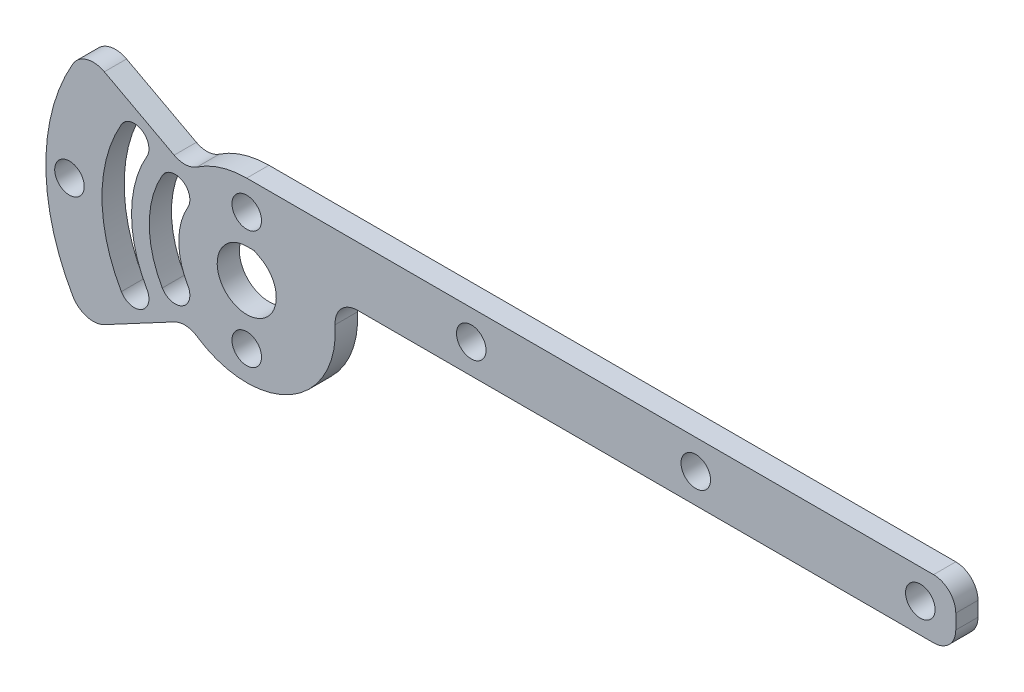
ISO-10303-21;
HEADER;
FILE_DESCRIPTION(('STEP AP214'),'2;1');
FILE_NAME('part.step','',(''),(''),'','','');
FILE_SCHEMA(('AUTOMOTIVE_DESIGN { 1 0 10303 214 1 1 1 1 }'));
ENDSEC;
DATA;
#1=APPLICATION_CONTEXT('core data for automotive mechanical design processes');
#2=APPLICATION_PROTOCOL_DEFINITION('international standard','automotive_design',2000,#1);
#3=PRODUCT_CONTEXT('',#1,'mechanical');
#4=PRODUCT('Part','Part','',(#3));
#5=PRODUCT_RELATED_PRODUCT_CATEGORY('part','',(#4));
#6=PRODUCT_DEFINITION_FORMATION('','',#4);
#7=PRODUCT_DEFINITION_CONTEXT('part definition',#1,'design');
#8=PRODUCT_DEFINITION('design','',#6,#7);
#9=PRODUCT_DEFINITION_SHAPE('','',#8);
#10=(LENGTH_UNIT() NAMED_UNIT(*) SI_UNIT(.MILLI.,.METRE.));
#11=(NAMED_UNIT(*) PLANE_ANGLE_UNIT() SI_UNIT($,.RADIAN.));
#12=(NAMED_UNIT(*) SI_UNIT($,.STERADIAN.) SOLID_ANGLE_UNIT());
#13=UNCERTAINTY_MEASURE_WITH_UNIT(LENGTH_MEASURE(1.E-05),#10,'distance_accuracy_value','');
#14=(GEOMETRIC_REPRESENTATION_CONTEXT(3) GLOBAL_UNCERTAINTY_ASSIGNED_CONTEXT((#13)) GLOBAL_UNIT_ASSIGNED_CONTEXT((#10,
#11,#12)) REPRESENTATION_CONTEXT('',''));
#15=CARTESIAN_POINT('',(0.,0.,0.));
#16=DIRECTION('',(0.,0.,1.));
#17=DIRECTION('',(1.,0.,0.));
#18=AXIS2_PLACEMENT_3D('',#15,#16,#17);
#19=CARTESIAN_POINT('',(2.98992691040184,5.60203865306684,4.7752));
#20=DIRECTION('',(0.470854631559345,0.882210811506589,0.));
#21=DIRECTION('',(-0.882210811506589,0.470854631559345,0.));
#22=AXIS2_PLACEMENT_3D('',#19,#20,#21);
#23=PLANE('',#22);
#24=DIRECTION('',(0.882210811506589,-0.470854631559345,0.));
#25=VECTOR('',#24,1.);
#26=CARTESIAN_POINT('',(2.98992691040184,5.60203865306684,0.));
#27=LINE('',#26,#25);
#28=CARTESIAN_POINT('',(1.58851861445243,6.35,0.));
#29=VERTEX_POINT('',#28);
#30=CARTESIAN_POINT('',(2.98992691040184,5.60203865306684,0.));
#31=VERTEX_POINT('',#30);
#32=EDGE_CURVE('E341',#29,#31,#27,.T.);
#33=ORIENTED_EDGE('',*,*,#32,.T.);
#34=DIRECTION('',(0.,0.,-1.));
#35=VECTOR('',#34,1.);
#36=CARTESIAN_POINT('',(2.98992691040184,5.60203865306684,4.7752));
#37=LINE('',#36,#35);
#38=CARTESIAN_POINT('',(2.98992691040184,5.60203865306684,4.7752));
#39=VERTEX_POINT('',#38);
#40=EDGE_CURVE('E357',#39,#31,#37,.T.);
#41=ORIENTED_EDGE('',*,*,#40,.F.);
#42=DIRECTION('',(0.882210811506589,-0.470854631559345,0.));
#43=VECTOR('',#42,1.);
#44=CARTESIAN_POINT('',(2.98992691040184,5.60203865306684,4.7752));
#45=LINE('',#44,#43);
#46=CARTESIAN_POINT('',(1.58851861445243,6.35,4.7752));
#47=VERTEX_POINT('',#46);
#48=EDGE_CURVE('E282',#47,#39,#45,.T.);
#49=ORIENTED_EDGE('',*,*,#48,.F.);
#50=DIRECTION('',(0.,0.,-1.));
#51=VECTOR('',#50,1.);
#52=CARTESIAN_POINT('',(1.58851861445243,6.35,4.7752));
#53=LINE('',#52,#51);
#54=EDGE_CURVE('E351',#47,#29,#53,.T.);
#55=ORIENTED_EDGE('',*,*,#54,.T.);
#56=EDGE_LOOP('',(#33,#41,#49,#55));
#57=FACE_BOUND('',#56,.T.);
#58=ADVANCED_FACE('F35',(#57),#23,.F.);
#59=CARTESIAN_POINT('',(0.,0.,4.7752));
#60=DIRECTION('',(0.,0.,-1.));
#61=DIRECTION('',(-1.,0.,0.));
#62=AXIS2_PLACEMENT_3D('',#59,#60,#61);
#63=CYLINDRICAL_SURFACE('',#62,6.35);
#64=CARTESIAN_POINT('',(0.,0.,0.));
#65=DIRECTION('',(0.,0.,1.));
#66=DIRECTION('',(1.,0.,0.));
#67=AXIS2_PLACEMENT_3D('',#64,#65,#66);
#68=CIRCLE('',#67,6.35);
#69=CARTESIAN_POINT('',(0.,6.35,0.));
#70=VERTEX_POINT('',#69);
#71=EDGE_CURVE('E344',#70,#31,#68,.T.);
#72=ORIENTED_EDGE('',*,*,#71,.F.);
#73=DIRECTION('',(0.,0.,-1.));
#74=VECTOR('',#73,1.);
#75=CARTESIAN_POINT('',(0.,6.35,4.7752));
#76=LINE('',#75,#74);
#77=CARTESIAN_POINT('',(0.,6.35,4.7752));
#78=VERTEX_POINT('',#77);
#79=EDGE_CURVE('E354',#78,#70,#76,.T.);
#80=ORIENTED_EDGE('',*,*,#79,.F.);
#81=CARTESIAN_POINT('',(0.,0.,4.7752));
#82=DIRECTION('',(0.,0.,1.));
#83=DIRECTION('',(1.,0.,0.));
#84=AXIS2_PLACEMENT_3D('',#81,#82,#83);
#85=CIRCLE('',#84,6.35);
#86=EDGE_CURVE('E284',#78,#39,#85,.T.);
#87=ORIENTED_EDGE('',*,*,#86,.T.);
#88=ORIENTED_EDGE('',*,*,#40,.T.);
#89=EDGE_LOOP('',(#72,#80,#87,#88));
#90=FACE_BOUND('',#89,.T.);
#91=ADVANCED_FACE('F453',(#90),#63,.F.);
#92=CARTESIAN_POINT('',(-15.3979316792874,-8.88999999999991,4.7752));
#93=DIRECTION('',(0.,0.,-1.));
#94=DIRECTION('',(-1.,0.,0.));
#95=AXIS2_PLACEMENT_3D('',#92,#93,#94);
#96=CYLINDRICAL_SURFACE('',#95,3.175);
#97=CARTESIAN_POINT('',(-15.3979316792874,-8.88999999999991,0.));
#98=DIRECTION('',(0.,0.,1.));
#99=DIRECTION('',(1.,0.,0.));
#100=AXIS2_PLACEMENT_3D('',#97,#98,#99);
#101=CIRCLE('',#100,3.175);
#102=CARTESIAN_POINT('',(-12.6483010222718,-7.30249999999992,0.));
#103=VERTEX_POINT('',#102);
#104=CARTESIAN_POINT('',(-18.147562336303,-10.4774999999999,0.));
#105=VERTEX_POINT('',#104);
#106=EDGE_CURVE('E330',#103,#105,#101,.F.);
#107=ORIENTED_EDGE('',*,*,#106,.T.);
#108=DIRECTION('',(0.,0.,-1.));
#109=VECTOR('',#108,1.);
#110=CARTESIAN_POINT('',(-18.147562336303,-10.4774999999999,4.7752));
#111=LINE('',#110,#109);
#112=CARTESIAN_POINT('',(-18.147562336303,-10.4774999999999,4.7752));
#113=VERTEX_POINT('',#112);
#114=EDGE_CURVE('E355',#113,#105,#111,.T.);
#115=ORIENTED_EDGE('',*,*,#114,.F.);
#116=CARTESIAN_POINT('',(-15.3979316792874,-8.88999999999991,4.7752));
#117=DIRECTION('',(0.,0.,1.));
#118=DIRECTION('',(1.,0.,0.));
#119=AXIS2_PLACEMENT_3D('',#116,#117,#118);
#120=CIRCLE('',#119,3.175);
#121=CARTESIAN_POINT('',(-12.6483010222718,-7.30249999999992,4.7752));
#122=VERTEX_POINT('',#121);
#123=EDGE_CURVE('E272',#122,#113,#120,.F.);
#124=ORIENTED_EDGE('',*,*,#123,.F.);
#125=DIRECTION('',(0.,0.,-1.));
#126=VECTOR('',#125,1.);
#127=CARTESIAN_POINT('',(-12.6483010222718,-7.30249999999992,4.7752));
#128=LINE('',#127,#126);
#129=EDGE_CURVE('E360',#122,#103,#128,.T.);
#130=ORIENTED_EDGE('',*,*,#129,.T.);
#131=EDGE_LOOP('',(#107,#115,#124,#130));
#132=FACE_BOUND('',#131,.T.);
#133=ADVANCED_FACE('F459',(#132),#96,.F.);
#134=CARTESIAN_POINT('',(0.,0.,4.7752));
#135=DIRECTION('',(0.,0.,-1.));
#136=DIRECTION('',(-1.,0.,0.));
#137=AXIS2_PLACEMENT_3D('',#134,#135,#136);
#138=CYLINDRICAL_SURFACE('',#137,20.955);
#139=CARTESIAN_POINT('',(0.,0.,0.));
#140=DIRECTION('',(0.,0.,1.));
#141=DIRECTION('',(1.,0.,0.));
#142=AXIS2_PLACEMENT_3D('',#139,#140,#141);
#143=CIRCLE('',#142,20.955);
#144=CARTESIAN_POINT('',(-18.147562336303,10.4774999999999,0.));
#145=VERTEX_POINT('',#144);
#146=EDGE_CURVE('E333',#145,#105,#143,.T.);
#147=ORIENTED_EDGE('',*,*,#146,.F.);
#148=DIRECTION('',(0.,0.,-1.));
#149=VECTOR('',#148,1.);
#150=CARTESIAN_POINT('',(-18.147562336303,10.4774999999999,4.7752));
#151=LINE('',#150,#149);
#152=CARTESIAN_POINT('',(-18.147562336303,10.4774999999999,4.7752));
#153=VERTEX_POINT('',#152);
#154=EDGE_CURVE('E366',#153,#145,#151,.T.);
#155=ORIENTED_EDGE('',*,*,#154,.F.);
#156=CARTESIAN_POINT('',(0.,0.,4.7752));
#157=DIRECTION('',(0.,0.,1.));
#158=DIRECTION('',(1.,0.,0.));
#159=AXIS2_PLACEMENT_3D('',#156,#157,#158);
#160=CIRCLE('',#159,20.955);
#161=EDGE_CURVE('E274',#153,#113,#160,.T.);
#162=ORIENTED_EDGE('',*,*,#161,.T.);
#163=ORIENTED_EDGE('',*,*,#114,.T.);
#164=EDGE_LOOP('',(#147,#155,#162,#163));
#165=FACE_BOUND('',#164,.T.);
#166=ADVANCED_FACE('F474',(#165),#138,.F.);
#167=CARTESIAN_POINT('',(-15.3979316792874,8.8899999999999,4.7752));
#168=DIRECTION('',(0.,0.,-1.));
#169=DIRECTION('',(-1.,0.,0.));
#170=AXIS2_PLACEMENT_3D('',#167,#168,#169);
#171=CYLINDRICAL_SURFACE('',#170,3.175);
#172=CARTESIAN_POINT('',(-15.3979316792874,8.8899999999999,0.));
#173=DIRECTION('',(0.,0.,1.));
#174=DIRECTION('',(1.,0.,0.));
#175=AXIS2_PLACEMENT_3D('',#172,#173,#174);
#176=CIRCLE('',#175,3.175);
#177=CARTESIAN_POINT('',(-12.6483010222718,7.30249999999992,0.));
#178=VERTEX_POINT('',#177);
#179=EDGE_CURVE('E336',#178,#145,#176,.T.);
#180=ORIENTED_EDGE('',*,*,#179,.F.);
#181=DIRECTION('',(0.,0.,-1.));
#182=VECTOR('',#181,1.);
#183=CARTESIAN_POINT('',(-12.6483010222718,7.30249999999992,4.7752));
#184=LINE('',#183,#182);
#185=CARTESIAN_POINT('',(-12.6483010222718,7.30249999999992,4.7752));
#186=VERTEX_POINT('',#185);
#187=EDGE_CURVE('E363',#186,#178,#184,.T.);
#188=ORIENTED_EDGE('',*,*,#187,.F.);
#189=CARTESIAN_POINT('',(-15.3979316792874,8.8899999999999,4.7752));
#190=DIRECTION('',(0.,0.,1.));
#191=DIRECTION('',(1.,0.,0.));
#192=AXIS2_PLACEMENT_3D('',#189,#190,#191);
#193=CIRCLE('',#192,3.175);
#194=EDGE_CURVE('E277',#186,#153,#193,.T.);
#195=ORIENTED_EDGE('',*,*,#194,.T.);
#196=ORIENTED_EDGE('',*,*,#154,.T.);
#197=EDGE_LOOP('',(#180,#188,#195,#196));
#198=FACE_BOUND('',#197,.T.);
#199=ADVANCED_FACE('F470',(#198),#171,.F.);
#200=CARTESIAN_POINT('',(0.,0.,4.7752));
#201=DIRECTION('',(0.,0.,-1.));
#202=DIRECTION('',(-1.,0.,0.));
#203=AXIS2_PLACEMENT_3D('',#200,#201,#202);
#204=CYLINDRICAL_SURFACE('',#203,24.765);
#205=CARTESIAN_POINT('',(0.,0.,0.));
#206=DIRECTION('',(0.,0.,1.));
#207=DIRECTION('',(1.,0.,0.));
#208=AXIS2_PLACEMENT_3D('',#205,#206,#207);
#209=CIRCLE('',#208,24.765);
#210=CARTESIAN_POINT('',(-21.4471191247217,12.3824999999999,0.));
#211=VERTEX_POINT('',#210);
#212=CARTESIAN_POINT('',(-21.4471191247217,-12.3824999999999,0.));
#213=VERTEX_POINT('',#212);
#214=EDGE_CURVE('E318',#211,#213,#209,.T.);
#215=ORIENTED_EDGE('',*,*,#214,.T.);
#216=DIRECTION('',(0.,0.,-1.));
#217=VECTOR('',#216,1.);
#218=CARTESIAN_POINT('',(-21.4471191247217,-12.3824999999999,4.7752));
#219=LINE('',#218,#217);
#220=CARTESIAN_POINT('',(-21.4471191247217,-12.3824999999999,4.7752));
#221=VERTEX_POINT('',#220);
#222=EDGE_CURVE('E364',#221,#213,#219,.T.);
#223=ORIENTED_EDGE('',*,*,#222,.F.);
#224=CARTESIAN_POINT('',(0.,0.,4.7752));
#225=DIRECTION('',(0.,0.,1.));
#226=DIRECTION('',(1.,0.,0.));
#227=AXIS2_PLACEMENT_3D('',#224,#225,#226);
#228=CIRCLE('',#227,24.765);
#229=CARTESIAN_POINT('',(-21.4471191247217,12.3824999999999,4.7752));
#230=VERTEX_POINT('',#229);
#231=EDGE_CURVE('E261',#230,#221,#228,.T.);
#232=ORIENTED_EDGE('',*,*,#231,.F.);
#233=DIRECTION('',(0.,0.,-1.));
#234=VECTOR('',#233,1.);
#235=CARTESIAN_POINT('',(-21.4471191247217,12.3824999999999,4.7752));
#236=LINE('',#235,#234);
#237=EDGE_CURVE('E234',#230,#211,#236,.T.);
#238=ORIENTED_EDGE('',*,*,#237,.T.);
#239=EDGE_LOOP('',(#215,#223,#232,#238));
#240=FACE_BOUND('',#239,.T.);
#241=ADVANCED_FACE('F473',(#240),#204,.T.);
#242=CARTESIAN_POINT('',(-24.1967497817373,-13.9699999999998,4.7752));
#243=DIRECTION('',(0.,0.,-1.));
#244=DIRECTION('',(-1.,0.,0.));
#245=AXIS2_PLACEMENT_3D('',#242,#243,#244);
#246=CYLINDRICAL_SURFACE('',#245,3.175);
#247=CARTESIAN_POINT('',(-24.1967497817373,-13.9699999999998,0.));
#248=DIRECTION('',(0.,0.,1.));
#249=DIRECTION('',(1.,0.,0.));
#250=AXIS2_PLACEMENT_3D('',#247,#248,#249);
#251=CIRCLE('',#250,3.175);
#252=CARTESIAN_POINT('',(-26.9463804387529,-15.5574999999999,0.));
#253=VERTEX_POINT('',#252);
#254=EDGE_CURVE('E321',#213,#253,#251,.F.);
#255=ORIENTED_EDGE('',*,*,#254,.T.);
#256=DIRECTION('',(0.,0.,-1.));
#257=VECTOR('',#256,1.);
#258=CARTESIAN_POINT('',(-26.9463804387529,-15.5574999999999,4.7752));
#259=LINE('',#258,#257);
#260=CARTESIAN_POINT('',(-26.9463804387529,-15.5574999999999,4.7752));
#261=VERTEX_POINT('',#260);
#262=EDGE_CURVE('E372',#261,#253,#259,.T.);
#263=ORIENTED_EDGE('',*,*,#262,.F.);
#264=CARTESIAN_POINT('',(-24.1967497817373,-13.9699999999998,4.7752));
#265=DIRECTION('',(0.,0.,1.));
#266=DIRECTION('',(1.,0.,0.));
#267=AXIS2_PLACEMENT_3D('',#264,#265,#266);
#268=CIRCLE('',#267,3.175);
#269=EDGE_CURVE('E264',#221,#261,#268,.F.);
#270=ORIENTED_EDGE('',*,*,#269,.F.);
#271=ORIENTED_EDGE('',*,*,#222,.T.);
#272=EDGE_LOOP('',(#255,#263,#270,#271));
#273=FACE_BOUND('',#272,.T.);
#274=ADVANCED_FACE('F489',(#273),#246,.F.);
#275=CARTESIAN_POINT('',(0.,0.,4.7752));
#276=DIRECTION('',(0.,0.,-1.));
#277=DIRECTION('',(-1.,0.,0.));
#278=AXIS2_PLACEMENT_3D('',#275,#276,#277);
#279=CYLINDRICAL_SURFACE('',#278,31.115);
#280=CARTESIAN_POINT('',(0.,0.,0.));
#281=DIRECTION('',(0.,0.,1.));
#282=DIRECTION('',(1.,0.,0.));
#283=AXIS2_PLACEMENT_3D('',#280,#281,#282);
#284=CIRCLE('',#283,31.115);
#285=CARTESIAN_POINT('',(-26.9463804387529,15.5574999999998,0.));
#286=VERTEX_POINT('',#285);
#287=EDGE_CURVE('E324',#286,#253,#284,.T.);
#288=ORIENTED_EDGE('',*,*,#287,.F.);
#289=DIRECTION('',(0.,0.,-1.));
#290=VECTOR('',#289,1.);
#291=CARTESIAN_POINT('',(-26.9463804387529,15.5574999999998,4.7752));
#292=LINE('',#291,#290);
#293=CARTESIAN_POINT('',(-26.9463804387529,15.5574999999998,4.7752));
#294=VERTEX_POINT('',#293);
#295=EDGE_CURVE('E370',#294,#286,#292,.T.);
#296=ORIENTED_EDGE('',*,*,#295,.F.);
#297=CARTESIAN_POINT('',(0.,0.,4.7752));
#298=DIRECTION('',(0.,0.,1.));
#299=DIRECTION('',(1.,0.,0.));
#300=AXIS2_PLACEMENT_3D('',#297,#298,#299);
#301=CIRCLE('',#300,31.115);
#302=EDGE_CURVE('E266',#294,#261,#301,.T.);
#303=ORIENTED_EDGE('',*,*,#302,.T.);
#304=ORIENTED_EDGE('',*,*,#262,.T.);
#305=EDGE_LOOP('',(#288,#296,#303,#304));
#306=FACE_BOUND('',#305,.T.);
#307=ADVANCED_FACE('F486',(#306),#279,.F.);
#308=CARTESIAN_POINT('',(0.,0.,4.7752));
#309=DIRECTION('',(0.,0.,-1.));
#310=DIRECTION('',(-1.,0.,0.));
#311=AXIS2_PLACEMENT_3D('',#308,#309,#310);
#312=CYLINDRICAL_SURFACE('',#311,43.18);
#313=CARTESIAN_POINT('',(0.,0.,0.));
#314=DIRECTION('',(0.,0.,1.));
#315=DIRECTION('',(1.,0.,0.));
#316=AXIS2_PLACEMENT_3D('',#313,#314,#315);
#317=CIRCLE('',#316,43.18);
#318=CARTESIAN_POINT('',(-37.3949769354122,21.5899999999998,0.));
#319=VERTEX_POINT('',#318);
#320=CARTESIAN_POINT('',(-37.3949769354122,-21.5899999999998,0.));
#321=VERTEX_POINT('',#320);
#322=EDGE_CURVE('E230',#319,#321,#317,.T.);
#323=ORIENTED_EDGE('',*,*,#322,.T.);
#324=DIRECTION('',(0.,0.,-1.));
#325=VECTOR('',#324,1.);
#326=CARTESIAN_POINT('',(-37.3949769354122,-21.5899999999998,4.7752));
#327=LINE('',#326,#325);
#328=CARTESIAN_POINT('',(-37.3949769354122,-21.5899999999998,4.7752));
#329=VERTEX_POINT('',#328);
#330=EDGE_CURVE('E227',#329,#321,#327,.T.);
#331=ORIENTED_EDGE('',*,*,#330,.F.);
#332=CARTESIAN_POINT('',(0.,0.,4.7752));
#333=DIRECTION('',(0.,0.,1.));
#334=DIRECTION('',(1.,0.,0.));
#335=AXIS2_PLACEMENT_3D('',#332,#333,#334);
#336=CIRCLE('',#335,43.18);
#337=CARTESIAN_POINT('',(-37.3949769354122,21.5899999999998,4.7752));
#338=VERTEX_POINT('',#337);
#339=EDGE_CURVE('E211',#338,#329,#336,.T.);
#340=ORIENTED_EDGE('',*,*,#339,.F.);
#341=DIRECTION('',(0.,0.,-1.));
#342=VECTOR('',#341,1.);
#343=CARTESIAN_POINT('',(-37.3949769354122,21.5899999999998,4.7752));
#344=LINE('',#343,#342);
#345=EDGE_CURVE('E292',#338,#319,#344,.T.);
#346=ORIENTED_EDGE('',*,*,#345,.T.);
#347=EDGE_LOOP('',(#323,#331,#340,#346));
#348=FACE_BOUND('',#347,.T.);
#349=ADVANCED_FACE('F228',(#348),#312,.T.);
#350=CARTESIAN_POINT('',(-32.9955678841872,-19.0499999999998,4.7752));
#351=DIRECTION('',(0.,0.,-1.));
#352=DIRECTION('',(-1.,0.,0.));
#353=AXIS2_PLACEMENT_3D('',#350,#351,#352);
#354=CYLINDRICAL_SURFACE('',#353,5.07999999999999);
#355=CARTESIAN_POINT('',(-32.9955678841872,-19.0499999999998,0.));
#356=DIRECTION('',(0.,0.,1.));
#357=DIRECTION('',(1.,0.,0.));
#358=AXIS2_PLACEMENT_3D('',#355,#356,#357);
#359=CIRCLE('',#358,5.07999999999999);
#360=CARTESIAN_POINT('',(-30.6036263558658,-23.5316309224533,0.));
#361=VERTEX_POINT('',#360);
#362=EDGE_CURVE('E294',#361,#321,#359,.F.);
#363=ORIENTED_EDGE('',*,*,#362,.F.);
#364=DIRECTION('',(0.,0.,-1.));
#365=VECTOR('',#364,1.);
#366=CARTESIAN_POINT('',(-30.6036263558658,-23.5316309224533,4.7752));
#367=LINE('',#366,#365);
#368=CARTESIAN_POINT('',(-30.6036263558658,-23.5316309224533,4.7752));
#369=VERTEX_POINT('',#368);
#370=EDGE_CURVE('E235',#369,#361,#367,.T.);
#371=ORIENTED_EDGE('',*,*,#370,.F.);
#372=CARTESIAN_POINT('',(-32.9955678841872,-19.0499999999998,4.7752));
#373=DIRECTION('',(0.,0.,1.));
#374=DIRECTION('',(1.,0.,0.));
#375=AXIS2_PLACEMENT_3D('',#372,#373,#374);
#376=CIRCLE('',#375,5.07999999999999);
#377=EDGE_CURVE('E218',#369,#329,#376,.F.);
#378=ORIENTED_EDGE('',*,*,#377,.T.);
#379=ORIENTED_EDGE('',*,*,#330,.T.);
#380=EDGE_LOOP('',(#363,#371,#378,#379));
#381=FACE_BOUND('',#380,.T.);
#382=ADVANCED_FACE('F237',(#381),#354,.T.);
#383=CARTESIAN_POINT('',(2.98992691040184,-5.60203865306683,4.7752));
#384=DIRECTION('',(-0.470854631559345,0.882210811506589,0.));
#385=DIRECTION('',(-0.882210811506589,-0.470854631559345,0.));
#386=AXIS2_PLACEMENT_3D('',#383,#384,#385);
#387=PLANE('',#386);
#388=DIRECTION('',(0.882210811506589,0.470854631559345,0.));
#389=VECTOR('',#388,1.);
#390=CARTESIAN_POINT('',(2.98992691040184,-5.60203865306683,0.));
#391=LINE('',#390,#389);
#392=CARTESIAN_POINT('',(-15.5966884477415,-15.5221096975923,0.));
#393=VERTEX_POINT('',#392);
#394=EDGE_CURVE('E296',#361,#393,#391,.T.);
#395=ORIENTED_EDGE('',*,*,#394,.T.);
#396=DIRECTION('',(0.,0.,1.));
#397=VECTOR('',#396,1.);
#398=CARTESIAN_POINT('',(-15.5966884477414,-15.5221096975923,4.7752));
#399=LINE('',#398,#397);
#400=CARTESIAN_POINT('',(-15.5966884477415,-15.5221096975923,4.7752));
#401=VERTEX_POINT('',#400);
#402=EDGE_CURVE('E407',#393,#401,#399,.T.);
#403=ORIENTED_EDGE('',*,*,#402,.T.);
#404=DIRECTION('',(0.882210811506589,0.470854631559345,0.));
#405=VECTOR('',#404,1.);
#406=CARTESIAN_POINT('',(2.98992691040184,-5.60203865306683,4.7752));
#407=LINE('',#406,#405);
#408=EDGE_CURVE('E239',#369,#401,#407,.T.);
#409=ORIENTED_EDGE('',*,*,#408,.F.);
#410=ORIENTED_EDGE('',*,*,#370,.T.);
#411=EDGE_LOOP('',(#395,#403,#409,#410));
#412=FACE_BOUND('',#411,.T.);
#413=ADVANCED_FACE('F523',(#412),#387,.F.);
#414=CARTESIAN_POINT('',(0.,0.,4.7752));
#415=DIRECTION('',(0.,0.,-1.));
#416=DIRECTION('',(-1.,0.,0.));
#417=AXIS2_PLACEMENT_3D('',#414,#415,#416);
#418=CYLINDRICAL_SURFACE('',#417,19.05);
#419=CARTESIAN_POINT('',(0.,0.,4.7752));
#420=DIRECTION('',(0.,0.,1.));
#421=DIRECTION('',(1.,0.,0.));
#422=AXIS2_PLACEMENT_3D('',#419,#420,#421);
#423=CIRCLE('',#422,19.05);
#424=CARTESIAN_POINT('',(-10.6729185056924,-15.7794585005585,4.7752));
#425=VERTEX_POINT('',#424);
#426=CARTESIAN_POINT('',(19.0083401387628,1.2591684434968,4.7752));
#427=VERTEX_POINT('',#426);
#428=EDGE_CURVE('E241',#425,#427,#423,.T.);
#429=ORIENTED_EDGE('',*,*,#428,.F.);
#430=DIRECTION('',(0.,0.,-1.));
#431=VECTOR('',#430,1.);
#432=CARTESIAN_POINT('',(-10.6729185056924,-15.7794585005585,4.7752));
#433=LINE('',#432,#431);
#434=CARTESIAN_POINT('',(-10.6729185056924,-15.7794585005585,0.));
#435=VERTEX_POINT('',#434);
#436=EDGE_CURVE('E404',#425,#435,#433,.T.);
#437=ORIENTED_EDGE('',*,*,#436,.T.);
#438=CARTESIAN_POINT('',(0.,0.,0.));
#439=DIRECTION('',(0.,0.,1.));
#440=DIRECTION('',(1.,0.,0.));
#441=AXIS2_PLACEMENT_3D('',#438,#439,#440);
#442=CIRCLE('',#441,19.05);
#443=CARTESIAN_POINT('',(19.0083401387628,1.2591684434968,0.));
#444=VERTEX_POINT('',#443);
#445=EDGE_CURVE('E299',#435,#444,#442,.T.);
#446=ORIENTED_EDGE('',*,*,#445,.T.);
#447=DIRECTION('',(0.,0.,-1.));
#448=VECTOR('',#447,1.);
#449=CARTESIAN_POINT('',(19.0083401387628,1.2591684434968,4.7752));
#450=LINE('',#449,#448);
#451=EDGE_CURVE('E402',#444,#427,#450,.F.);
#452=ORIENTED_EDGE('',*,*,#451,.T.);
#453=EDGE_LOOP('',(#429,#437,#446,#452));
#454=FACE_BOUND('',#453,.T.);
#455=ADVANCED_FACE('F519',(#454),#418,.T.);
#456=CARTESIAN_POINT('',(0.,6.35,4.7752));
#457=DIRECTION('',(0.,1.,0.));
#458=DIRECTION('',(-1.,0.,0.));
#459=AXIS2_PLACEMENT_3D('',#456,#457,#458);
#460=PLANE('',#459);
#461=DIRECTION('',(1.,0.,0.));
#462=VECTOR('',#461,1.);
#463=CARTESIAN_POINT('',(0.,6.35,0.));
#464=LINE('',#463,#462);
#465=CARTESIAN_POINT('',(23.7730974002127,6.35,0.));
#466=VERTEX_POINT('',#465);
#467=CARTESIAN_POINT('',(147.6248,6.35,0.));
#468=VERTEX_POINT('',#467);
#469=EDGE_CURVE('E302',#466,#468,#464,.T.);
#470=ORIENTED_EDGE('',*,*,#469,.T.);
#471=DIRECTION('',(0.,0.,-1.));
#472=VECTOR('',#471,1.);
#473=CARTESIAN_POINT('',(147.6248,6.35,4.7752));
#474=LINE('',#473,#472);
#475=CARTESIAN_POINT('',(147.6248,6.35,4.7752));
#476=VERTEX_POINT('',#475);
#477=EDGE_CURVE('E400',#468,#476,#474,.F.);
#478=ORIENTED_EDGE('',*,*,#477,.T.);
#479=DIRECTION('',(1.,0.,0.));
#480=VECTOR('',#479,1.);
#481=CARTESIAN_POINT('',(0.,6.35,4.7752));
#482=LINE('',#481,#480);
#483=CARTESIAN_POINT('',(23.7730974002127,6.35,4.7752));
#484=VERTEX_POINT('',#483);
#485=EDGE_CURVE('E247',#484,#476,#482,.T.);
#486=ORIENTED_EDGE('',*,*,#485,.F.);
#487=DIRECTION('',(0.,0.,1.));
#488=VECTOR('',#487,1.);
#489=CARTESIAN_POINT('',(23.7730974002127,6.35,0.));
#490=LINE('',#489,#488);
#491=EDGE_CURVE('E397',#484,#466,#490,.F.);
#492=ORIENTED_EDGE('',*,*,#491,.T.);
#493=EDGE_LOOP('',(#470,#478,#486,#492));
#494=FACE_BOUND('',#493,.T.);
#495=ADVANCED_FACE('F515',(#494),#460,.F.);
#496=CARTESIAN_POINT('',(152.4,0.,4.7752));
#497=DIRECTION('',(1.,0.,0.));
#498=DIRECTION('',(0.,0.,-1.));
#499=AXIS2_PLACEMENT_3D('',#496,#497,#498);
#500=PLANE('',#499);
#501=DIRECTION('',(0.,-1.,0.));
#502=VECTOR('',#501,1.);
#503=CARTESIAN_POINT('',(152.4,0.,0.));
#504=LINE('',#503,#502);
#505=CARTESIAN_POINT('',(152.4,14.2748,0.));
#506=VERTEX_POINT('',#505);
#507=CARTESIAN_POINT('',(152.4,11.1252,0.));
#508=VERTEX_POINT('',#507);
#509=EDGE_CURVE('E305',#506,#508,#504,.T.);
#510=ORIENTED_EDGE('',*,*,#509,.F.);
#511=DIRECTION('',(0.,0.,-1.));
#512=VECTOR('',#511,1.);
#513=CARTESIAN_POINT('',(152.4,14.2748,4.7752));
#514=LINE('',#513,#512);
#515=CARTESIAN_POINT('',(152.4,14.2748,4.7752));
#516=VERTEX_POINT('',#515);
#517=EDGE_CURVE('E391',#506,#516,#514,.F.);
#518=ORIENTED_EDGE('',*,*,#517,.T.);
#519=DIRECTION('',(0.,-1.,0.));
#520=VECTOR('',#519,1.);
#521=CARTESIAN_POINT('',(152.4,0.,4.7752));
#522=LINE('',#521,#520);
#523=CARTESIAN_POINT('',(152.4,11.1252,4.7752));
#524=VERTEX_POINT('',#523);
#525=EDGE_CURVE('E250',#516,#524,#522,.T.);
#526=ORIENTED_EDGE('',*,*,#525,.T.);
#527=DIRECTION('',(0.,0.,-1.));
#528=VECTOR('',#527,1.);
#529=CARTESIAN_POINT('',(152.4,11.1252,0.));
#530=LINE('',#529,#528);
#531=EDGE_CURVE('E388',#524,#508,#530,.T.);
#532=ORIENTED_EDGE('',*,*,#531,.T.);
#533=EDGE_LOOP('',(#510,#518,#526,#532));
#534=FACE_BOUND('',#533,.T.);
#535=ADVANCED_FACE('F511',(#534),#500,.T.);
#536=CARTESIAN_POINT('',(0.,19.05,4.7752));
#537=DIRECTION('',(0.,1.,0.));
#538=DIRECTION('',(0.,0.,1.));
#539=AXIS2_PLACEMENT_3D('',#536,#537,#538);
#540=PLANE('',#539);
#541=DIRECTION('',(1.,0.,0.));
#542=VECTOR('',#541,1.);
#543=CARTESIAN_POINT('',(0.,19.05,4.7752));
#544=LINE('',#543,#542);
#545=CARTESIAN_POINT('',(0.,19.05,4.7752));
#546=VERTEX_POINT('',#545);
#547=CARTESIAN_POINT('',(147.6248,19.05,4.7752));
#548=VERTEX_POINT('',#547);
#549=EDGE_CURVE('E253',#546,#548,#544,.T.);
#550=ORIENTED_EDGE('',*,*,#549,.T.);
#551=DIRECTION('',(0.,0.,-1.));
#552=VECTOR('',#551,1.);
#553=CARTESIAN_POINT('',(147.6248,19.05,4.7752));
#554=LINE('',#553,#552);
#555=CARTESIAN_POINT('',(147.6248,19.05,0.));
#556=VERTEX_POINT('',#555);
#557=EDGE_CURVE('E359',#548,#556,#554,.T.);
#558=ORIENTED_EDGE('',*,*,#557,.T.);
#559=DIRECTION('',(1.,0.,0.));
#560=VECTOR('',#559,1.);
#561=CARTESIAN_POINT('',(0.,19.05,0.));
#562=LINE('',#561,#560);
#563=CARTESIAN_POINT('',(0.,19.05,0.));
#564=VERTEX_POINT('',#563);
#565=EDGE_CURVE('E308',#564,#556,#562,.T.);
#566=ORIENTED_EDGE('',*,*,#565,.F.);
#567=DIRECTION('',(0.,0.,-1.));
#568=VECTOR('',#567,1.);
#569=CARTESIAN_POINT('',(0.,19.05,4.7752));
#570=LINE('',#569,#568);
#571=EDGE_CURVE('E379',#546,#564,#570,.T.);
#572=ORIENTED_EDGE('',*,*,#571,.F.);
#573=EDGE_LOOP('',(#550,#558,#566,#572));
#574=FACE_BOUND('',#573,.T.);
#575=ADVANCED_FACE('F508',(#574),#540,.T.);
#576=CARTESIAN_POINT('',(0.,0.,4.7752));
#577=DIRECTION('',(0.,0.,-1.));
#578=DIRECTION('',(-1.,0.,0.));
#579=AXIS2_PLACEMENT_3D('',#576,#577,#578);
#580=CYLINDRICAL_SURFACE('',#579,19.05);
#581=CARTESIAN_POINT('',(0.,0.,0.));
#582=DIRECTION('',(0.,0.,1.));
#583=DIRECTION('',(1.,0.,0.));
#584=AXIS2_PLACEMENT_3D('',#581,#582,#583);
#585=CIRCLE('',#584,19.05);
#586=CARTESIAN_POINT('',(-10.6729185056924,15.7794585005585,0.));
#587=VERTEX_POINT('',#586);
#588=EDGE_CURVE('E311',#564,#587,#585,.T.);
#589=ORIENTED_EDGE('',*,*,#588,.T.);
#590=DIRECTION('',(0.,0.,-1.));
#591=VECTOR('',#590,1.);
#592=CARTESIAN_POINT('',(-10.6729185056924,15.7794585005585,4.7752));
#593=LINE('',#592,#591);
#594=CARTESIAN_POINT('',(-10.6729185056924,15.7794585005585,4.7752));
#595=VERTEX_POINT('',#594);
#596=EDGE_CURVE('E60',#587,#595,#593,.F.);
#597=ORIENTED_EDGE('',*,*,#596,.T.);
#598=CARTESIAN_POINT('',(0.,0.,4.7752));
#599=DIRECTION('',(0.,0.,1.));
#600=DIRECTION('',(1.,0.,0.));
#601=AXIS2_PLACEMENT_3D('',#598,#599,#600);
#602=CIRCLE('',#601,19.05);
#603=EDGE_CURVE('E256',#546,#595,#602,.T.);
#604=ORIENTED_EDGE('',*,*,#603,.F.);
#605=ORIENTED_EDGE('',*,*,#571,.T.);
#606=EDGE_LOOP('',(#589,#597,#604,#605));
#607=FACE_BOUND('',#606,.T.);
#608=ADVANCED_FACE('F504',(#607),#580,.T.);
#609=CARTESIAN_POINT('',(2.98992691040184,5.60203865306684,4.7752));
#610=DIRECTION('',(0.470854631559345,0.882210811506589,0.));
#611=DIRECTION('',(-0.882210811506589,0.470854631559345,0.));
#612=AXIS2_PLACEMENT_3D('',#609,#610,#611);
#613=PLANE('',#612);
#614=DIRECTION('',(0.882210811506589,-0.470854631559345,0.));
#615=VECTOR('',#614,1.);
#616=CARTESIAN_POINT('',(2.98992691040184,5.60203865306684,4.7752));
#617=LINE('',#616,#615);
#618=CARTESIAN_POINT('',(-30.6036263558658,23.5316309224533,4.7752));
#619=VERTEX_POINT('',#618);
#620=CARTESIAN_POINT('',(-15.5966884477414,15.5221096975923,4.7752));
#621=VERTEX_POINT('',#620);
#622=EDGE_CURVE('E258',#619,#621,#617,.T.);
#623=ORIENTED_EDGE('',*,*,#622,.T.);
#624=DIRECTION('',(0.,0.,-1.));
#625=VECTOR('',#624,1.);
#626=CARTESIAN_POINT('',(-15.5966884477414,15.5221096975923,4.7752));
#627=LINE('',#626,#625);
#628=CARTESIAN_POINT('',(-15.5966884477414,15.5221096975923,0.));
#629=VERTEX_POINT('',#628);
#630=EDGE_CURVE('E409',#621,#629,#627,.T.);
#631=ORIENTED_EDGE('',*,*,#630,.T.);
#632=DIRECTION('',(0.882210811506589,-0.470854631559345,0.));
#633=VECTOR('',#632,1.);
#634=CARTESIAN_POINT('',(2.98992691040184,5.60203865306684,0.));
#635=LINE('',#634,#633);
#636=CARTESIAN_POINT('',(-30.6036263558658,23.5316309224533,0.));
#637=VERTEX_POINT('',#636);
#638=EDGE_CURVE('E313',#637,#629,#635,.T.);
#639=ORIENTED_EDGE('',*,*,#638,.F.);
#640=DIRECTION('',(0.,0.,-1.));
#641=VECTOR('',#640,1.);
#642=CARTESIAN_POINT('',(-30.6036263558658,23.5316309224533,4.7752));
#643=LINE('',#642,#641);
#644=EDGE_CURVE('E377',#619,#637,#643,.T.);
#645=ORIENTED_EDGE('',*,*,#644,.F.);
#646=EDGE_LOOP('',(#623,#631,#639,#645));
#647=FACE_BOUND('',#646,.T.);
#648=ADVANCED_FACE('F501',(#647),#613,.T.);
#649=CARTESIAN_POINT('',(0.,6.35,4.7752));
#650=DIRECTION('',(0.,1.,0.));
#651=DIRECTION('',(-1.,0.,0.));
#652=AXIS2_PLACEMENT_3D('',#649,#650,#651);
#653=PLANE('',#652);
#654=DIRECTION('',(1.,0.,0.));
#655=VECTOR('',#654,1.);
#656=CARTESIAN_POINT('',(0.,6.35,0.));
#657=LINE('',#656,#655);
#658=EDGE_CURVE('E347',#70,#29,#657,.T.);
#659=ORIENTED_EDGE('',*,*,#658,.T.);
#660=ORIENTED_EDGE('',*,*,#54,.F.);
#661=DIRECTION('',(1.,0.,0.));
#662=VECTOR('',#661,1.);
#663=CARTESIAN_POINT('',(0.,6.35,4.7752));
#664=LINE('',#663,#662);
#665=EDGE_CURVE('E287',#78,#47,#664,.T.);
#666=ORIENTED_EDGE('',*,*,#665,.F.);
#667=ORIENTED_EDGE('',*,*,#79,.T.);
#668=EDGE_LOOP('',(#659,#660,#666,#667));
#669=FACE_BOUND('',#668,.T.);
#670=ADVANCED_FACE('F468',(#669),#653,.F.);
#671=CARTESIAN_POINT('',(0.,0.,4.7752));
#672=DIRECTION('',(0.,0.,-1.));
#673=DIRECTION('',(-1.,0.,0.));
#674=AXIS2_PLACEMENT_3D('',#671,#672,#673);
#675=CYLINDRICAL_SURFACE('',#674,14.605);
#676=CARTESIAN_POINT('',(0.,0.,0.));
#677=DIRECTION('',(0.,0.,1.));
#678=DIRECTION('',(1.,0.,0.));
#679=AXIS2_PLACEMENT_3D('',#676,#677,#678);
#680=CIRCLE('',#679,14.605);
#681=EDGE_CURVE('E339',#178,#103,#680,.T.);
#682=ORIENTED_EDGE('',*,*,#681,.T.);
#683=ORIENTED_EDGE('',*,*,#129,.F.);
#684=CARTESIAN_POINT('',(0.,0.,4.7752));
#685=DIRECTION('',(0.,0.,1.));
#686=DIRECTION('',(1.,0.,0.));
#687=AXIS2_PLACEMENT_3D('',#684,#685,#686);
#688=CIRCLE('',#687,14.605);
#689=EDGE_CURVE('E280',#186,#122,#688,.T.);
#690=ORIENTED_EDGE('',*,*,#689,.F.);
#691=ORIENTED_EDGE('',*,*,#187,.T.);
#692=EDGE_LOOP('',(#682,#683,#690,#691));
#693=FACE_BOUND('',#692,.T.);
#694=ADVANCED_FACE('F464',(#693),#675,.T.);
#695=CARTESIAN_POINT('',(-24.1967497817373,13.9699999999998,4.7752));
#696=DIRECTION('',(0.,0.,-1.));
#697=DIRECTION('',(-1.,0.,0.));
#698=AXIS2_PLACEMENT_3D('',#695,#696,#697);
#699=CYLINDRICAL_SURFACE('',#698,3.175);
#700=CARTESIAN_POINT('',(-24.1967497817373,13.9699999999998,0.));
#701=DIRECTION('',(0.,0.,1.));
#702=DIRECTION('',(1.,0.,0.));
#703=AXIS2_PLACEMENT_3D('',#700,#701,#702);
#704=CIRCLE('',#703,3.175);
#705=EDGE_CURVE('E327',#211,#286,#704,.T.);
#706=ORIENTED_EDGE('',*,*,#705,.F.);
#707=ORIENTED_EDGE('',*,*,#237,.F.);
#708=CARTESIAN_POINT('',(-24.1967497817373,13.9699999999998,4.7752));
#709=DIRECTION('',(0.,0.,1.));
#710=DIRECTION('',(1.,0.,0.));
#711=AXIS2_PLACEMENT_3D('',#708,#709,#710);
#712=CIRCLE('',#711,3.175);
#713=EDGE_CURVE('E269',#230,#294,#712,.T.);
#714=ORIENTED_EDGE('',*,*,#713,.T.);
#715=ORIENTED_EDGE('',*,*,#295,.T.);
#716=EDGE_LOOP('',(#706,#707,#714,#715));
#717=FACE_BOUND('',#716,.T.);
#718=ADVANCED_FACE('F467',(#717),#699,.F.);
#719=CARTESIAN_POINT('',(-32.9955678841872,19.0499999999998,4.7752));
#720=DIRECTION('',(0.,0.,-1.));
#721=DIRECTION('',(-1.,0.,0.));
#722=AXIS2_PLACEMENT_3D('',#719,#720,#721);
#723=CYLINDRICAL_SURFACE('',#722,5.08);
#724=CARTESIAN_POINT('',(-32.9955678841872,19.0499999999998,0.));
#725=DIRECTION('',(0.,0.,1.));
#726=DIRECTION('',(1.,0.,0.));
#727=AXIS2_PLACEMENT_3D('',#724,#725,#726);
#728=CIRCLE('',#727,5.08);
#729=EDGE_CURVE('E316',#637,#319,#728,.T.);
#730=ORIENTED_EDGE('',*,*,#729,.T.);
#731=ORIENTED_EDGE('',*,*,#345,.F.);
#732=CARTESIAN_POINT('',(-32.9955678841872,19.0499999999998,4.7752));
#733=DIRECTION('',(0.,0.,1.));
#734=DIRECTION('',(1.,0.,0.));
#735=AXIS2_PLACEMENT_3D('',#732,#733,#734);
#736=CIRCLE('',#735,5.08);
#737=EDGE_CURVE('E220',#619,#338,#736,.T.);
#738=ORIENTED_EDGE('',*,*,#737,.F.);
#739=ORIENTED_EDGE('',*,*,#644,.T.);
#740=EDGE_LOOP('',(#730,#731,#738,#739));
#741=FACE_BOUND('',#740,.T.);
#742=ADVANCED_FACE('F484',(#741),#723,.T.);
#743=CARTESIAN_POINT('',(-38.1,0.,4.7752));
#744=DIRECTION('',(0.,0.,-1.));
#745=DIRECTION('',(-1.,0.,0.));
#746=AXIS2_PLACEMENT_3D('',#743,#744,#745);
#747=CYLINDRICAL_SURFACE('',#746,3.175);
#748=CARTESIAN_POINT('',(-38.1,0.,4.7752));
#749=DIRECTION('',(0.,0.,1.));
#750=DIRECTION('',(1.,0.,0.));
#751=AXIS2_PLACEMENT_3D('',#748,#749,#750);
#752=CIRCLE('',#751,3.175);
#753=CARTESIAN_POINT('',(-34.925,0.,4.7752));
#754=VERTEX_POINT('',#753);
#755=EDGE_CURVE('E289',#754,#754,#752,.T.);
#756=ORIENTED_EDGE('',*,*,#755,.T.);
#757=EDGE_LOOP('',(#756));
#758=FACE_BOUND('',#757,.T.);
#759=CARTESIAN_POINT('',(-38.1,0.,0.));
#760=DIRECTION('',(0.,0.,1.));
#761=DIRECTION('',(1.,0.,0.));
#762=AXIS2_PLACEMENT_3D('',#759,#760,#761);
#763=CIRCLE('',#762,3.175);
#764=CARTESIAN_POINT('',(-34.925,0.,0.));
#765=VERTEX_POINT('',#764);
#766=EDGE_CURVE('E224',#765,#765,#763,.T.);
#767=ORIENTED_EDGE('',*,*,#766,.F.);
#768=EDGE_LOOP('',(#767));
#769=FACE_BOUND('',#768,.T.);
#770=ADVANCED_FACE('F499',(#758,#769),#747,.F.);
#771=CARTESIAN_POINT('',(0.,0.,4.7752));
#772=DIRECTION('',(0.,0.,1.));
#773=DIRECTION('',(1.,0.,0.));
#774=AXIS2_PLACEMENT_3D('',#771,#772,#773);
#775=PLANE('',#774);
#776=CARTESIAN_POINT('',(144.78,12.7,4.7752));
#777=DIRECTION('',(0.,0.,1.));
#778=DIRECTION('',(1.,0.,0.));
#779=AXIS2_PLACEMENT_3D('',#776,#777,#778);
#780=CIRCLE('',#779,3.175);
#781=CARTESIAN_POINT('',(147.955,12.7,4.7752));
#782=VERTEX_POINT('',#781);
#783=EDGE_CURVE('E775',#782,#782,#780,.T.);
#784=ORIENTED_EDGE('',*,*,#783,.F.);
#785=EDGE_LOOP('',(#784));
#786=FACE_BOUND('',#785,.T.);
#787=CARTESIAN_POINT('',(96.52,12.7,4.7752));
#788=DIRECTION('',(0.,0.,1.));
#789=DIRECTION('',(1.,0.,0.));
#790=AXIS2_PLACEMENT_3D('',#787,#788,#789);
#791=CIRCLE('',#790,3.175);
#792=CARTESIAN_POINT('',(99.695,12.7,4.7752));
#793=VERTEX_POINT('',#792);
#794=EDGE_CURVE('E770',#793,#793,#791,.T.);
#795=ORIENTED_EDGE('',*,*,#794,.F.);
#796=EDGE_LOOP('',(#795));
#797=FACE_BOUND('',#796,.T.);
#798=CARTESIAN_POINT('',(48.26,12.7,4.7752));
#799=DIRECTION('',(0.,0.,1.));
#800=DIRECTION('',(1.,0.,0.));
#801=AXIS2_PLACEMENT_3D('',#798,#799,#800);
#802=CIRCLE('',#801,3.175);
#803=CARTESIAN_POINT('',(51.435,12.7,4.7752));
#804=VERTEX_POINT('',#803);
#805=EDGE_CURVE('E759',#804,#804,#802,.T.);
#806=ORIENTED_EDGE('',*,*,#805,.F.);
#807=EDGE_LOOP('',(#806));
#808=FACE_BOUND('',#807,.T.);
#809=CARTESIAN_POINT('',(0.,-12.7,4.7752));
#810=DIRECTION('',(0.,0.,1.));
#811=DIRECTION('',(1.,0.,0.));
#812=AXIS2_PLACEMENT_3D('',#809,#810,#811);
#813=CIRCLE('',#812,3.175);
#814=CARTESIAN_POINT('',(3.175,-12.7,4.7752));
#815=VERTEX_POINT('',#814);
#816=EDGE_CURVE('E769',#815,#815,#813,.T.);
#817=ORIENTED_EDGE('',*,*,#816,.F.);
#818=EDGE_LOOP('',(#817));
#819=FACE_BOUND('',#818,.T.);
#820=CARTESIAN_POINT('',(0.,12.7,4.7752));
#821=DIRECTION('',(0.,0.,1.));
#822=DIRECTION('',(1.,0.,0.));
#823=AXIS2_PLACEMENT_3D('',#820,#821,#822);
#824=CIRCLE('',#823,3.175);
#825=CARTESIAN_POINT('',(3.175,12.7,4.7752));
#826=VERTEX_POINT('',#825);
#827=EDGE_CURVE('E425',#826,#826,#824,.T.);
#828=ORIENTED_EDGE('',*,*,#827,.F.);
#829=EDGE_LOOP('',(#828));
#830=FACE_BOUND('',#829,.T.);
#831=ORIENTED_EDGE('',*,*,#525,.F.);
#832=CARTESIAN_POINT('',(147.6248,14.2748,4.7752));
#833=DIRECTION('',(0.,0.,1.));
#834=DIRECTION('',(1.,0.,0.));
#835=AXIS2_PLACEMENT_3D('',#832,#833,#834);
#836=CIRCLE('',#835,4.7752);
#837=EDGE_CURVE('E395',#516,#548,#836,.T.);
#838=ORIENTED_EDGE('',*,*,#837,.T.);
#839=ORIENTED_EDGE('',*,*,#549,.F.);
#840=ORIENTED_EDGE('',*,*,#603,.T.);
#841=CARTESIAN_POINT('',(-13.3482634111193,19.7348427646986,4.7752));
#842=DIRECTION('',(0.,0.,1.));
#843=DIRECTION('',(1.,0.,0.));
#844=AXIS2_PLACEMENT_3D('',#841,#842,#843);
#845=CIRCLE('',#844,4.7752);
#846=EDGE_CURVE('E52',#595,#621,#845,.F.);
#847=ORIENTED_EDGE('',*,*,#846,.T.);
#848=ORIENTED_EDGE('',*,*,#622,.F.);
#849=ORIENTED_EDGE('',*,*,#737,.T.);
#850=ORIENTED_EDGE('',*,*,#339,.T.);
#851=ORIENTED_EDGE('',*,*,#377,.F.);
#852=ORIENTED_EDGE('',*,*,#408,.T.);
#853=CARTESIAN_POINT('',(-13.3482634111193,-19.7348427646985,4.7752));
#854=DIRECTION('',(0.,0.,1.));
#855=DIRECTION('',(1.,0.,0.));
#856=AXIS2_PLACEMENT_3D('',#853,#854,#855);
#857=CIRCLE('',#856,4.7752);
#858=EDGE_CURVE('E415',#401,#425,#857,.F.);
#859=ORIENTED_EDGE('',*,*,#858,.T.);
#860=ORIENTED_EDGE('',*,*,#428,.T.);
#861=CARTESIAN_POINT('',(23.7730974002127,1.5748,4.7752));
#862=DIRECTION('',(0.,0.,1.));
#863=DIRECTION('',(1.,0.,0.));
#864=AXIS2_PLACEMENT_3D('',#861,#862,#863);
#865=CIRCLE('',#864,4.7752);
#866=EDGE_CURVE('E11',#427,#484,#865,.F.);
#867=ORIENTED_EDGE('',*,*,#866,.T.);
#868=ORIENTED_EDGE('',*,*,#485,.T.);
#869=CARTESIAN_POINT('',(147.6248,11.1252,4.7752));
#870=DIRECTION('',(0.,0.,1.));
#871=DIRECTION('',(1.,0.,0.));
#872=AXIS2_PLACEMENT_3D('',#869,#870,#871);
#873=CIRCLE('',#872,4.7752);
#874=EDGE_CURVE('E393',#476,#524,#873,.T.);
#875=ORIENTED_EDGE('',*,*,#874,.T.);
#876=EDGE_LOOP('',(#831,#838,#839,#840,#847,#848,#849,#850,#851,#852,#859,#860,#867,#868,#875));
#877=FACE_BOUND('',#876,.T.);
#878=ORIENTED_EDGE('',*,*,#231,.T.);
#879=ORIENTED_EDGE('',*,*,#269,.T.);
#880=ORIENTED_EDGE('',*,*,#302,.F.);
#881=ORIENTED_EDGE('',*,*,#713,.F.);
#882=EDGE_LOOP('',(#878,#879,#880,#881));
#883=FACE_BOUND('',#882,.T.);
#884=ORIENTED_EDGE('',*,*,#123,.T.);
#885=ORIENTED_EDGE('',*,*,#161,.F.);
#886=ORIENTED_EDGE('',*,*,#194,.F.);
#887=ORIENTED_EDGE('',*,*,#689,.T.);
#888=EDGE_LOOP('',(#884,#885,#886,#887));
#889=FACE_BOUND('',#888,.T.);
#890=ORIENTED_EDGE('',*,*,#48,.T.);
#891=ORIENTED_EDGE('',*,*,#86,.F.);
#892=ORIENTED_EDGE('',*,*,#665,.T.);
#893=EDGE_LOOP('',(#890,#891,#892));
#894=FACE_BOUND('',#893,.T.);
#895=ORIENTED_EDGE('',*,*,#755,.F.);
#896=EDGE_LOOP('',(#895));
#897=FACE_BOUND('',#896,.T.);
#898=ADVANCED_FACE('F214',(#786,#797,#808,#819,#830,#877,#883,#889,#894,#897),#775,.T.);
#899=CARTESIAN_POINT('',(0.,0.,0.));
#900=DIRECTION('',(0.,0.,1.));
#901=DIRECTION('',(1.,0.,0.));
#902=AXIS2_PLACEMENT_3D('',#899,#900,#901);
#903=PLANE('',#902);
#904=CARTESIAN_POINT('',(144.78,12.7,0.));
#905=DIRECTION('',(0.,0.,1.));
#906=DIRECTION('',(1.,0.,0.));
#907=AXIS2_PLACEMENT_3D('',#904,#905,#906);
#908=CIRCLE('',#907,3.175);
#909=CARTESIAN_POINT('',(147.955,12.7,0.));
#910=VERTEX_POINT('',#909);
#911=EDGE_CURVE('E39',#910,#910,#908,.T.);
#912=ORIENTED_EDGE('',*,*,#911,.T.);
#913=EDGE_LOOP('',(#912));
#914=FACE_BOUND('',#913,.T.);
#915=CARTESIAN_POINT('',(96.52,12.7,0.));
#916=DIRECTION('',(0.,0.,1.));
#917=DIRECTION('',(1.,0.,0.));
#918=AXIS2_PLACEMENT_3D('',#915,#916,#917);
#919=CIRCLE('',#918,3.175);
#920=CARTESIAN_POINT('',(99.695,12.7,0.));
#921=VERTEX_POINT('',#920);
#922=EDGE_CURVE('E430',#921,#921,#919,.T.);
#923=ORIENTED_EDGE('',*,*,#922,.T.);
#924=EDGE_LOOP('',(#923));
#925=FACE_BOUND('',#924,.T.);
#926=CARTESIAN_POINT('',(48.26,12.7,0.));
#927=DIRECTION('',(0.,0.,1.));
#928=DIRECTION('',(1.,0.,0.));
#929=AXIS2_PLACEMENT_3D('',#926,#927,#928);
#930=CIRCLE('',#929,3.175);
#931=CARTESIAN_POINT('',(51.435,12.7,0.));
#932=VERTEX_POINT('',#931);
#933=EDGE_CURVE('E428',#932,#932,#930,.T.);
#934=ORIENTED_EDGE('',*,*,#933,.T.);
#935=EDGE_LOOP('',(#934));
#936=FACE_BOUND('',#935,.T.);
#937=CARTESIAN_POINT('',(0.,-12.7,0.));
#938=DIRECTION('',(0.,0.,1.));
#939=DIRECTION('',(1.,0.,0.));
#940=AXIS2_PLACEMENT_3D('',#937,#938,#939);
#941=CIRCLE('',#940,3.175);
#942=CARTESIAN_POINT('',(3.175,-12.7,0.));
#943=VERTEX_POINT('',#942);
#944=EDGE_CURVE('E424',#943,#943,#941,.T.);
#945=ORIENTED_EDGE('',*,*,#944,.T.);
#946=EDGE_LOOP('',(#945));
#947=FACE_BOUND('',#946,.T.);
#948=CARTESIAN_POINT('',(0.,12.7,0.));
#949=DIRECTION('',(0.,0.,1.));
#950=DIRECTION('',(1.,0.,0.));
#951=AXIS2_PLACEMENT_3D('',#948,#949,#950);
#952=CIRCLE('',#951,3.175);
#953=CARTESIAN_POINT('',(3.175,12.7,0.));
#954=VERTEX_POINT('',#953);
#955=EDGE_CURVE('E421',#954,#954,#952,.T.);
#956=ORIENTED_EDGE('',*,*,#955,.T.);
#957=EDGE_LOOP('',(#956));
#958=FACE_BOUND('',#957,.T.);
#959=ORIENTED_EDGE('',*,*,#565,.T.);
#960=CARTESIAN_POINT('',(147.6248,14.2748,0.));
#961=DIRECTION('',(0.,0.,1.));
#962=DIRECTION('',(1.,0.,0.));
#963=AXIS2_PLACEMENT_3D('',#960,#961,#962);
#964=CIRCLE('',#963,4.7752);
#965=EDGE_CURVE('E386',#556,#506,#964,.F.);
#966=ORIENTED_EDGE('',*,*,#965,.T.);
#967=ORIENTED_EDGE('',*,*,#509,.T.);
#968=CARTESIAN_POINT('',(147.6248,11.1252,0.));
#969=DIRECTION('',(0.,0.,1.));
#970=DIRECTION('',(1.,0.,0.));
#971=AXIS2_PLACEMENT_3D('',#968,#969,#970);
#972=CIRCLE('',#971,4.7752);
#973=EDGE_CURVE('E384',#508,#468,#972,.F.);
#974=ORIENTED_EDGE('',*,*,#973,.T.);
#975=ORIENTED_EDGE('',*,*,#469,.F.);
#976=CARTESIAN_POINT('',(23.7730974002127,1.5748,0.));
#977=DIRECTION('',(0.,0.,1.));
#978=DIRECTION('',(1.,0.,0.));
#979=AXIS2_PLACEMENT_3D('',#976,#977,#978);
#980=CIRCLE('',#979,4.7752);
#981=EDGE_CURVE('E44',#466,#444,#980,.T.);
#982=ORIENTED_EDGE('',*,*,#981,.T.);
#983=ORIENTED_EDGE('',*,*,#445,.F.);
#984=CARTESIAN_POINT('',(-13.3482634111193,-19.7348427646985,0.));
#985=DIRECTION('',(0.,0.,1.));
#986=DIRECTION('',(1.,0.,0.));
#987=AXIS2_PLACEMENT_3D('',#984,#985,#986);
#988=CIRCLE('',#987,4.7752);
#989=EDGE_CURVE('E413',#435,#393,#988,.T.);
#990=ORIENTED_EDGE('',*,*,#989,.T.);
#991=ORIENTED_EDGE('',*,*,#394,.F.);
#992=ORIENTED_EDGE('',*,*,#362,.T.);
#993=ORIENTED_EDGE('',*,*,#322,.F.);
#994=ORIENTED_EDGE('',*,*,#729,.F.);
#995=ORIENTED_EDGE('',*,*,#638,.T.);
#996=CARTESIAN_POINT('',(-13.3482634111193,19.7348427646986,0.));
#997=DIRECTION('',(0.,0.,1.));
#998=DIRECTION('',(1.,0.,0.));
#999=AXIS2_PLACEMENT_3D('',#996,#997,#998);
#1000=CIRCLE('',#999,4.7752);
#1001=EDGE_CURVE('E417',#629,#587,#1000,.T.);
#1002=ORIENTED_EDGE('',*,*,#1001,.T.);
#1003=ORIENTED_EDGE('',*,*,#588,.F.);
#1004=EDGE_LOOP('',(#959,#966,#967,#974,#975,#982,#983,#990,#991,#992,#993,#994,#995,#1002,#1003));
#1005=FACE_BOUND('',#1004,.T.);
#1006=ORIENTED_EDGE('',*,*,#214,.F.);
#1007=ORIENTED_EDGE('',*,*,#705,.T.);
#1008=ORIENTED_EDGE('',*,*,#287,.T.);
#1009=ORIENTED_EDGE('',*,*,#254,.F.);
#1010=EDGE_LOOP('',(#1006,#1007,#1008,#1009));
#1011=FACE_BOUND('',#1010,.T.);
#1012=ORIENTED_EDGE('',*,*,#106,.F.);
#1013=ORIENTED_EDGE('',*,*,#681,.F.);
#1014=ORIENTED_EDGE('',*,*,#179,.T.);
#1015=ORIENTED_EDGE('',*,*,#146,.T.);
#1016=EDGE_LOOP('',(#1012,#1013,#1014,#1015));
#1017=FACE_BOUND('',#1016,.T.);
#1018=ORIENTED_EDGE('',*,*,#32,.F.);
#1019=ORIENTED_EDGE('',*,*,#658,.F.);
#1020=ORIENTED_EDGE('',*,*,#71,.T.);
#1021=EDGE_LOOP('',(#1018,#1019,#1020));
#1022=FACE_BOUND('',#1021,.T.);
#1023=ORIENTED_EDGE('',*,*,#766,.T.);
#1024=EDGE_LOOP('',(#1023));
#1025=FACE_BOUND('',#1024,.T.);
#1026=ADVANCED_FACE('F437',(#914,#925,#936,#947,#958,#1005,#1011,#1017,#1022,#1025),#903,.F.);
#1027=CARTESIAN_POINT('',(147.6248,14.2748,4.7752));
#1028=DIRECTION('',(0.,0.,-1.));
#1029=DIRECTION('',(-1.,0.,0.));
#1030=AXIS2_PLACEMENT_3D('',#1027,#1028,#1029);
#1031=CYLINDRICAL_SURFACE('',#1030,4.7752);
#1032=ORIENTED_EDGE('',*,*,#837,.F.);
#1033=ORIENTED_EDGE('',*,*,#517,.F.);
#1034=ORIENTED_EDGE('',*,*,#965,.F.);
#1035=ORIENTED_EDGE('',*,*,#557,.F.);
#1036=EDGE_LOOP('',(#1032,#1033,#1034,#1035));
#1037=FACE_BOUND('',#1036,.T.);
#1038=ADVANCED_FACE('F532',(#1037),#1031,.T.);
#1039=CARTESIAN_POINT('',(147.6248,11.1252,4.7752));
#1040=DIRECTION('',(0.,0.,1.));
#1041=DIRECTION('',(1.,0.,0.));
#1042=AXIS2_PLACEMENT_3D('',#1039,#1040,#1041);
#1043=CYLINDRICAL_SURFACE('',#1042,4.7752);
#1044=ORIENTED_EDGE('',*,*,#874,.F.);
#1045=ORIENTED_EDGE('',*,*,#477,.F.);
#1046=ORIENTED_EDGE('',*,*,#973,.F.);
#1047=ORIENTED_EDGE('',*,*,#531,.F.);
#1048=EDGE_LOOP('',(#1044,#1045,#1046,#1047));
#1049=FACE_BOUND('',#1048,.T.);
#1050=ADVANCED_FACE('F535',(#1049),#1043,.T.);
#1051=CARTESIAN_POINT('',(-13.3482634111193,-19.7348427646985,4.7752));
#1052=DIRECTION('',(0.,0.,-1.));
#1053=DIRECTION('',(-1.,0.,0.));
#1054=AXIS2_PLACEMENT_3D('',#1051,#1052,#1053);
#1055=CYLINDRICAL_SURFACE('',#1054,4.7752);
#1056=ORIENTED_EDGE('',*,*,#858,.F.);
#1057=ORIENTED_EDGE('',*,*,#402,.F.);
#1058=ORIENTED_EDGE('',*,*,#989,.F.);
#1059=ORIENTED_EDGE('',*,*,#436,.F.);
#1060=EDGE_LOOP('',(#1056,#1057,#1058,#1059));
#1061=FACE_BOUND('',#1060,.T.);
#1062=ADVANCED_FACE('F539',(#1061),#1055,.F.);
#1063=CARTESIAN_POINT('',(-13.3482634111193,19.7348427646986,4.7752));
#1064=DIRECTION('',(0.,0.,-1.));
#1065=DIRECTION('',(-1.,0.,0.));
#1066=AXIS2_PLACEMENT_3D('',#1063,#1064,#1065);
#1067=CYLINDRICAL_SURFACE('',#1066,4.7752);
#1068=ORIENTED_EDGE('',*,*,#846,.F.);
#1069=ORIENTED_EDGE('',*,*,#596,.F.);
#1070=ORIENTED_EDGE('',*,*,#1001,.F.);
#1071=ORIENTED_EDGE('',*,*,#630,.F.);
#1072=EDGE_LOOP('',(#1068,#1069,#1070,#1071));
#1073=FACE_BOUND('',#1072,.T.);
#1074=ADVANCED_FACE('F542',(#1073),#1067,.F.);
#1075=CARTESIAN_POINT('',(23.7730974002127,1.5748,4.7752));
#1076=DIRECTION('',(0.,0.,-1.));
#1077=DIRECTION('',(-1.,0.,0.));
#1078=AXIS2_PLACEMENT_3D('',#1075,#1076,#1077);
#1079=CYLINDRICAL_SURFACE('',#1078,4.7752);
#1080=ORIENTED_EDGE('',*,*,#866,.F.);
#1081=ORIENTED_EDGE('',*,*,#451,.F.);
#1082=ORIENTED_EDGE('',*,*,#981,.F.);
#1083=ORIENTED_EDGE('',*,*,#491,.F.);
#1084=EDGE_LOOP('',(#1080,#1081,#1082,#1083));
#1085=FACE_BOUND('',#1084,.T.);
#1086=ADVANCED_FACE('F37',(#1085),#1079,.F.);
#1087=CARTESIAN_POINT('',(0.,12.7,-7.874));
#1088=DIRECTION('',(0.,0.,1.));
#1089=DIRECTION('',(1.,0.,0.));
#1090=AXIS2_PLACEMENT_3D('',#1087,#1088,#1089);
#1091=CYLINDRICAL_SURFACE('',#1090,3.175);
#1092=ORIENTED_EDGE('',*,*,#827,.T.);
#1093=EDGE_LOOP('',(#1092));
#1094=FACE_BOUND('',#1093,.T.);
#1095=ORIENTED_EDGE('',*,*,#955,.F.);
#1096=EDGE_LOOP('',(#1095));
#1097=FACE_BOUND('',#1096,.T.);
#1098=ADVANCED_FACE('F549',(#1094,#1097),#1091,.F.);
#1099=CARTESIAN_POINT('',(0.,-12.7,-7.874));
#1100=DIRECTION('',(0.,0.,1.));
#1101=DIRECTION('',(1.,0.,0.));
#1102=AXIS2_PLACEMENT_3D('',#1099,#1100,#1101);
#1103=CYLINDRICAL_SURFACE('',#1102,3.175);
#1104=ORIENTED_EDGE('',*,*,#816,.T.);
#1105=EDGE_LOOP('',(#1104));
#1106=FACE_BOUND('',#1105,.T.);
#1107=ORIENTED_EDGE('',*,*,#944,.F.);
#1108=EDGE_LOOP('',(#1107));
#1109=FACE_BOUND('',#1108,.T.);
#1110=ADVANCED_FACE('F724',(#1106,#1109),#1103,.F.);
#1111=CARTESIAN_POINT('',(48.26,12.7,-7.874));
#1112=DIRECTION('',(0.,0.,1.));
#1113=DIRECTION('',(1.,0.,0.));
#1114=AXIS2_PLACEMENT_3D('',#1111,#1112,#1113);
#1115=CYLINDRICAL_SURFACE('',#1114,3.175);
#1116=ORIENTED_EDGE('',*,*,#805,.T.);
#1117=EDGE_LOOP('',(#1116));
#1118=FACE_BOUND('',#1117,.T.);
#1119=ORIENTED_EDGE('',*,*,#933,.F.);
#1120=EDGE_LOOP('',(#1119));
#1121=FACE_BOUND('',#1120,.T.);
#1122=ADVANCED_FACE('F447',(#1118,#1121),#1115,.F.);
#1123=CARTESIAN_POINT('',(96.52,12.7,-7.874));
#1124=DIRECTION('',(0.,0.,1.));
#1125=DIRECTION('',(1.,0.,0.));
#1126=AXIS2_PLACEMENT_3D('',#1123,#1124,#1125);
#1127=CYLINDRICAL_SURFACE('',#1126,3.175);
#1128=ORIENTED_EDGE('',*,*,#794,.T.);
#1129=EDGE_LOOP('',(#1128));
#1130=FACE_BOUND('',#1129,.T.);
#1131=ORIENTED_EDGE('',*,*,#922,.F.);
#1132=EDGE_LOOP('',(#1131));
#1133=FACE_BOUND('',#1132,.T.);
#1134=ADVANCED_FACE('F441',(#1130,#1133),#1127,.F.);
#1135=CARTESIAN_POINT('',(144.78,12.7,-7.874));
#1136=DIRECTION('',(0.,0.,1.));
#1137=DIRECTION('',(1.,0.,0.));
#1138=AXIS2_PLACEMENT_3D('',#1135,#1136,#1137);
#1139=CYLINDRICAL_SURFACE('',#1138,3.175);
#1140=ORIENTED_EDGE('',*,*,#783,.T.);
#1141=EDGE_LOOP('',(#1140));
#1142=FACE_BOUND('',#1141,.T.);
#1143=ORIENTED_EDGE('',*,*,#911,.F.);
#1144=EDGE_LOOP('',(#1143));
#1145=FACE_BOUND('',#1144,.T.);
#1146=ADVANCED_FACE('F439',(#1142,#1145),#1139,.F.);
#1147=CLOSED_SHELL('',(#58,#91,#133,#166,#199,#241,#274,#307,#349,#382,#413,#455,#495,#535,#575,
#608,#648,#670,#694,#718,#742,#770,#898,#1026,#1038,#1050,#1062,#1074,#1086,#1098,#1110,#1122,
#1134,#1146));
#1148=MANIFOLD_SOLID_BREP('B2',#1147);
#1149=ADVANCED_BREP_SHAPE_REPRESENTATION('',(#18,#1148),#14);
#1150=SHAPE_DEFINITION_REPRESENTATION(#9,#1149);
ENDSEC;
END-ISO-10303-21;
